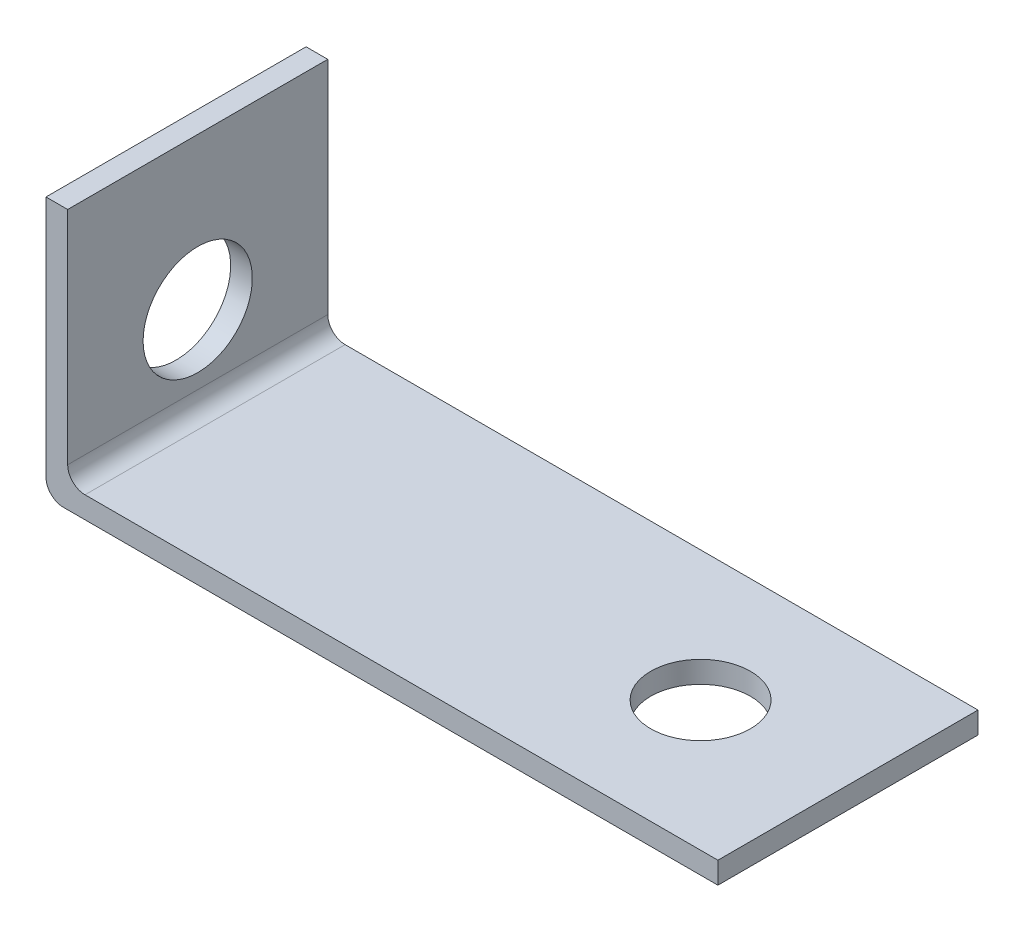
ISO-10303-21;
HEADER;
FILE_DESCRIPTION(('STEP AP214'),'2;1');
FILE_NAME('part.step','',(''),(''),'','','');
FILE_SCHEMA(('AUTOMOTIVE_DESIGN { 1 0 10303 214 1 1 1 1 }'));
ENDSEC;
DATA;
#1=APPLICATION_CONTEXT('core data for automotive mechanical design processes');
#2=APPLICATION_PROTOCOL_DEFINITION('international standard','automotive_design',2000,#1);
#3=PRODUCT_CONTEXT('',#1,'mechanical');
#4=PRODUCT('Part','Part','',(#3));
#5=PRODUCT_RELATED_PRODUCT_CATEGORY('part','',(#4));
#6=PRODUCT_DEFINITION_FORMATION('','',#4);
#7=PRODUCT_DEFINITION_CONTEXT('part definition',#1,'design');
#8=PRODUCT_DEFINITION('design','',#6,#7);
#9=PRODUCT_DEFINITION_SHAPE('','',#8);
#10=(LENGTH_UNIT() NAMED_UNIT(*) SI_UNIT(.MILLI.,.METRE.));
#11=(NAMED_UNIT(*) PLANE_ANGLE_UNIT() SI_UNIT($,.RADIAN.));
#12=(NAMED_UNIT(*) SI_UNIT($,.STERADIAN.) SOLID_ANGLE_UNIT());
#13=UNCERTAINTY_MEASURE_WITH_UNIT(LENGTH_MEASURE(1.E-05),#10,'distance_accuracy_value','');
#14=(GEOMETRIC_REPRESENTATION_CONTEXT(3) GLOBAL_UNCERTAINTY_ASSIGNED_CONTEXT((#13)) GLOBAL_UNIT_ASSIGNED_CONTEXT((#10,
#11,#12)) REPRESENTATION_CONTEXT('',''));
#15=CARTESIAN_POINT('',(0.,0.,0.));
#16=DIRECTION('',(0.,0.,1.));
#17=DIRECTION('',(1.,0.,0.));
#18=AXIS2_PLACEMENT_3D('',#15,#16,#17);
#19=CARTESIAN_POINT('',(47.625,3.175,19.05));
#20=DIRECTION('',(-1.,0.,0.));
#21=DIRECTION('',(0.,0.,1.));
#22=AXIS2_PLACEMENT_3D('',#19,#20,#21);
#23=PLANE('',#22);
#24=DIRECTION('',(0.,0.,-1.));
#25=VECTOR('',#24,1.);
#26=CARTESIAN_POINT('',(47.625,0.,19.05));
#27=LINE('',#26,#25);
#28=CARTESIAN_POINT('',(47.625,0.,19.05));
#29=VERTEX_POINT('',#28);
#30=CARTESIAN_POINT('',(47.625,0.,-19.05));
#31=VERTEX_POINT('',#30);
#32=EDGE_CURVE('E113',#29,#31,#27,.T.);
#33=ORIENTED_EDGE('',*,*,#32,.T.);
#34=DIRECTION('',(0.,-1.,0.));
#35=VECTOR('',#34,1.);
#36=CARTESIAN_POINT('',(47.625,3.175,-19.05));
#37=LINE('',#36,#35);
#38=CARTESIAN_POINT('',(47.625,3.175,-19.05));
#39=VERTEX_POINT('',#38);
#40=EDGE_CURVE('E147',#39,#31,#37,.T.);
#41=ORIENTED_EDGE('',*,*,#40,.F.);
#42=DIRECTION('',(0.,0.,-1.));
#43=VECTOR('',#42,1.);
#44=CARTESIAN_POINT('',(47.625,3.175,19.05));
#45=LINE('',#44,#43);
#46=CARTESIAN_POINT('',(47.625,3.175,19.05));
#47=VERTEX_POINT('',#46);
#48=EDGE_CURVE('E130',#47,#39,#45,.T.);
#49=ORIENTED_EDGE('',*,*,#48,.F.);
#50=DIRECTION('',(0.,-1.,0.));
#51=VECTOR('',#50,1.);
#52=CARTESIAN_POINT('',(47.625,3.175,19.05));
#53=LINE('',#52,#51);
#54=EDGE_CURVE('E139',#47,#29,#53,.T.);
#55=ORIENTED_EDGE('',*,*,#54,.T.);
#56=EDGE_LOOP('',(#33,#41,#49,#55));
#57=FACE_BOUND('',#56,.T.);
#58=ADVANCED_FACE('F32',(#57),#23,.F.);
#59=CARTESIAN_POINT('',(-47.625,3.175,-19.05));
#60=DIRECTION('',(0.,0.,1.));
#61=DIRECTION('',(1.,0.,0.));
#62=AXIS2_PLACEMENT_3D('',#59,#60,#61);
#63=PLANE('',#62);
#64=DIRECTION('',(-1.,0.,0.));
#65=VECTOR('',#64,1.);
#66=CARTESIAN_POINT('',(-47.625,0.,-19.05));
#67=LINE('',#66,#65);
#68=CARTESIAN_POINT('',(-48.26,0.,-19.05));
#69=VERTEX_POINT('',#68);
#70=EDGE_CURVE('E142',#31,#69,#67,.T.);
#71=ORIENTED_EDGE('',*,*,#70,.T.);
#72=CARTESIAN_POINT('',(-48.26,2.54,-19.05));
#73=DIRECTION('',(0.,0.,1.));
#74=DIRECTION('',(1.,0.,0.));
#75=AXIS2_PLACEMENT_3D('',#72,#73,#74);
#76=CIRCLE('',#75,2.54);
#77=CARTESIAN_POINT('',(-50.8,2.54,-19.05));
#78=VERTEX_POINT('',#77);
#79=EDGE_CURVE('E158',#69,#78,#76,.F.);
#80=ORIENTED_EDGE('',*,*,#79,.T.);
#81=DIRECTION('',(0.,-1.,0.));
#82=VECTOR('',#81,1.);
#83=CARTESIAN_POINT('',(-50.8,0.,-19.05));
#84=LINE('',#83,#82);
#85=CARTESIAN_POINT('',(-50.8,38.1,-19.05));
#86=VERTEX_POINT('',#85);
#87=EDGE_CURVE('E104',#86,#78,#84,.T.);
#88=ORIENTED_EDGE('',*,*,#87,.F.);
#89=DIRECTION('',(1.,0.,0.));
#90=VECTOR('',#89,1.);
#91=CARTESIAN_POINT('',(-50.8,38.1,-19.05));
#92=LINE('',#91,#90);
#93=CARTESIAN_POINT('',(-47.625,38.1,-19.05));
#94=VERTEX_POINT('',#93);
#95=EDGE_CURVE('E114',#86,#94,#92,.T.);
#96=ORIENTED_EDGE('',*,*,#95,.T.);
#97=DIRECTION('',(0.,-1.,0.));
#98=VECTOR('',#97,1.);
#99=CARTESIAN_POINT('',(-47.625,0.,-19.05));
#100=LINE('',#99,#98);
#101=CARTESIAN_POINT('',(-47.625,5.715,-19.05));
#102=VERTEX_POINT('',#101);
#103=EDGE_CURVE('E123',#94,#102,#100,.T.);
#104=ORIENTED_EDGE('',*,*,#103,.T.);
#105=CARTESIAN_POINT('',(-45.085,5.715,-19.05));
#106=DIRECTION('',(0.,0.,1.));
#107=DIRECTION('',(1.,0.,0.));
#108=AXIS2_PLACEMENT_3D('',#105,#106,#107);
#109=CIRCLE('',#108,2.54);
#110=CARTESIAN_POINT('',(-45.085,3.175,-19.05));
#111=VERTEX_POINT('',#110);
#112=EDGE_CURVE('E11',#102,#111,#109,.T.);
#113=ORIENTED_EDGE('',*,*,#112,.T.);
#114=DIRECTION('',(-1.,0.,0.));
#115=VECTOR('',#114,1.);
#116=CARTESIAN_POINT('',(-47.625,3.175,-19.05));
#117=LINE('',#116,#115);
#118=EDGE_CURVE('E133',#39,#111,#117,.T.);
#119=ORIENTED_EDGE('',*,*,#118,.F.);
#120=ORIENTED_EDGE('',*,*,#40,.T.);
#121=EDGE_LOOP('',(#71,#80,#88,#96,#104,#113,#119,#120));
#122=FACE_BOUND('',#121,.T.);
#123=ADVANCED_FACE('F170',(#122),#63,.F.);
#124=CARTESIAN_POINT('',(-47.625,3.175,19.05));
#125=DIRECTION('',(0.,0.,-1.));
#126=DIRECTION('',(-1.,0.,0.));
#127=AXIS2_PLACEMENT_3D('',#124,#125,#126);
#128=PLANE('',#127);
#129=DIRECTION('',(0.,1.,0.));
#130=VECTOR('',#129,1.);
#131=CARTESIAN_POINT('',(-50.8,0.,19.05));
#132=LINE('',#131,#130);
#133=CARTESIAN_POINT('',(-50.8,2.54,19.05));
#134=VERTEX_POINT('',#133);
#135=CARTESIAN_POINT('',(-50.8,38.1,19.05));
#136=VERTEX_POINT('',#135);
#137=EDGE_CURVE('E95',#134,#136,#132,.T.);
#138=ORIENTED_EDGE('',*,*,#137,.F.);
#139=CARTESIAN_POINT('',(-48.26,2.54,19.05));
#140=DIRECTION('',(0.,0.,-1.));
#141=DIRECTION('',(-1.,0.,0.));
#142=AXIS2_PLACEMENT_3D('',#139,#140,#141);
#143=CIRCLE('',#142,2.54);
#144=CARTESIAN_POINT('',(-48.26,0.,19.05));
#145=VERTEX_POINT('',#144);
#146=EDGE_CURVE('E55',#134,#145,#143,.F.);
#147=ORIENTED_EDGE('',*,*,#146,.T.);
#148=DIRECTION('',(1.,0.,0.));
#149=VECTOR('',#148,1.);
#150=CARTESIAN_POINT('',(-47.625,0.,19.05));
#151=LINE('',#150,#149);
#152=EDGE_CURVE('E134',#145,#29,#151,.T.);
#153=ORIENTED_EDGE('',*,*,#152,.T.);
#154=ORIENTED_EDGE('',*,*,#54,.F.);
#155=DIRECTION('',(1.,0.,0.));
#156=VECTOR('',#155,1.);
#157=CARTESIAN_POINT('',(-47.625,3.175,19.05));
#158=LINE('',#157,#156);
#159=CARTESIAN_POINT('',(-45.085,3.175,19.05));
#160=VERTEX_POINT('',#159);
#161=EDGE_CURVE('E137',#160,#47,#158,.T.);
#162=ORIENTED_EDGE('',*,*,#161,.F.);
#163=CARTESIAN_POINT('',(-45.085,5.715,19.05));
#164=DIRECTION('',(0.,0.,-1.));
#165=DIRECTION('',(-1.,0.,0.));
#166=AXIS2_PLACEMENT_3D('',#163,#164,#165);
#167=CIRCLE('',#166,2.54);
#168=CARTESIAN_POINT('',(-47.625,5.715,19.05));
#169=VERTEX_POINT('',#168);
#170=EDGE_CURVE('E40',#160,#169,#167,.T.);
#171=ORIENTED_EDGE('',*,*,#170,.T.);
#172=DIRECTION('',(0.,1.,0.));
#173=VECTOR('',#172,1.);
#174=CARTESIAN_POINT('',(-47.625,0.,19.05));
#175=LINE('',#174,#173);
#176=CARTESIAN_POINT('',(-47.625,38.1,19.05));
#177=VERTEX_POINT('',#176);
#178=EDGE_CURVE('E110',#169,#177,#175,.T.);
#179=ORIENTED_EDGE('',*,*,#178,.T.);
#180=DIRECTION('',(1.,0.,0.));
#181=VECTOR('',#180,1.);
#182=CARTESIAN_POINT('',(-50.8,38.1,19.05));
#183=LINE('',#182,#181);
#184=EDGE_CURVE('E107',#136,#177,#183,.T.);
#185=ORIENTED_EDGE('',*,*,#184,.F.);
#186=EDGE_LOOP('',(#138,#147,#153,#154,#162,#171,#179,#185));
#187=FACE_BOUND('',#186,.T.);
#188=ADVANCED_FACE('F108',(#187),#128,.F.);
#189=CARTESIAN_POINT('',(0.,3.175,0.));
#190=DIRECTION('',(0.,-1.,0.));
#191=DIRECTION('',(0.,0.,-1.));
#192=AXIS2_PLACEMENT_3D('',#189,#190,#191);
#193=PLANE('',#192);
#194=CARTESIAN_POINT('',(26.035,3.175,0.));
#195=DIRECTION('',(0.,-1.,0.));
#196=DIRECTION('',(0.,0.,-1.));
#197=AXIS2_PLACEMENT_3D('',#194,#195,#196);
#198=CIRCLE('',#197,7.30250000000001);
#199=CARTESIAN_POINT('',(26.035,3.175,-7.30250000000001));
#200=VERTEX_POINT('',#199);
#201=EDGE_CURVE('E126',#200,#200,#198,.F.);
#202=ORIENTED_EDGE('',*,*,#201,.F.);
#203=EDGE_LOOP('',(#202));
#204=FACE_BOUND('',#203,.T.);
#205=ORIENTED_EDGE('',*,*,#118,.T.);
#206=DIRECTION('',(0.,0.,1.));
#207=VECTOR('',#206,1.);
#208=CARTESIAN_POINT('',(-45.085,3.175,0.));
#209=LINE('',#208,#207);
#210=EDGE_CURVE('E150',#111,#160,#209,.T.);
#211=ORIENTED_EDGE('',*,*,#210,.T.);
#212=ORIENTED_EDGE('',*,*,#161,.T.);
#213=ORIENTED_EDGE('',*,*,#48,.T.);
#214=EDGE_LOOP('',(#205,#211,#212,#213));
#215=FACE_BOUND('',#214,.T.);
#216=ADVANCED_FACE('F172',(#204,#215),#193,.F.);
#217=CARTESIAN_POINT('',(0.,0.,0.));
#218=DIRECTION('',(0.,-1.,0.));
#219=DIRECTION('',(0.,0.,-1.));
#220=AXIS2_PLACEMENT_3D('',#217,#218,#219);
#221=PLANE('',#220);
#222=CARTESIAN_POINT('',(26.035,0.,0.));
#223=DIRECTION('',(0.,1.,0.));
#224=DIRECTION('',(0.,0.,1.));
#225=AXIS2_PLACEMENT_3D('',#222,#223,#224);
#226=CIRCLE('',#225,7.30250000000001);
#227=CARTESIAN_POINT('',(26.035,0.,7.30250000000001));
#228=VERTEX_POINT('',#227);
#229=EDGE_CURVE('E224',#228,#228,#226,.T.);
#230=ORIENTED_EDGE('',*,*,#229,.T.);
#231=EDGE_LOOP('',(#230));
#232=FACE_BOUND('',#231,.T.);
#233=ORIENTED_EDGE('',*,*,#152,.F.);
#234=DIRECTION('',(0.,0.,1.));
#235=VECTOR('',#234,1.);
#236=CARTESIAN_POINT('',(-48.26,0.,-19.05));
#237=LINE('',#236,#235);
#238=EDGE_CURVE('E47',#145,#69,#237,.F.);
#239=ORIENTED_EDGE('',*,*,#238,.T.);
#240=ORIENTED_EDGE('',*,*,#70,.F.);
#241=ORIENTED_EDGE('',*,*,#32,.F.);
#242=EDGE_LOOP('',(#233,#239,#240,#241));
#243=FACE_BOUND('',#242,.T.);
#244=ADVANCED_FACE('F193',(#232,#243),#221,.T.);
#245=CARTESIAN_POINT('',(-47.625,0.,0.));
#246=DIRECTION('',(1.,0.,0.));
#247=DIRECTION('',(0.,0.,-1.));
#248=AXIS2_PLACEMENT_3D('',#245,#246,#247);
#249=PLANE('',#248);
#250=CARTESIAN_POINT('',(-47.625,15.875,0.));
#251=DIRECTION('',(-1.,0.,0.));
#252=DIRECTION('',(0.,0.,1.));
#253=AXIS2_PLACEMENT_3D('',#250,#251,#252);
#254=CIRCLE('',#253,8.001);
#255=CARTESIAN_POINT('',(-47.625,15.875,8.001));
#256=VERTEX_POINT('',#255);
#257=EDGE_CURVE('E222',#256,#256,#254,.T.);
#258=ORIENTED_EDGE('',*,*,#257,.T.);
#259=EDGE_LOOP('',(#258));
#260=FACE_BOUND('',#259,.T.);
#261=ORIENTED_EDGE('',*,*,#178,.F.);
#262=DIRECTION('',(0.,0.,1.));
#263=VECTOR('',#262,1.);
#264=CARTESIAN_POINT('',(-47.625,5.715,0.));
#265=LINE('',#264,#263);
#266=EDGE_CURVE('E153',#169,#102,#265,.F.);
#267=ORIENTED_EDGE('',*,*,#266,.T.);
#268=ORIENTED_EDGE('',*,*,#103,.F.);
#269=DIRECTION('',(0.,0.,-1.));
#270=VECTOR('',#269,1.);
#271=CARTESIAN_POINT('',(-47.625,38.1,-19.05));
#272=LINE('',#271,#270);
#273=EDGE_CURVE('E128',#177,#94,#272,.T.);
#274=ORIENTED_EDGE('',*,*,#273,.F.);
#275=EDGE_LOOP('',(#261,#267,#268,#274));
#276=FACE_BOUND('',#275,.T.);
#277=ADVANCED_FACE('F165',(#260,#276),#249,.T.);
#278=CARTESIAN_POINT('',(-50.8,38.1,-19.05));
#279=DIRECTION('',(0.,-1.,0.));
#280=DIRECTION('',(0.,0.,-1.));
#281=AXIS2_PLACEMENT_3D('',#278,#279,#280);
#282=PLANE('',#281);
#283=ORIENTED_EDGE('',*,*,#273,.T.);
#284=ORIENTED_EDGE('',*,*,#95,.F.);
#285=DIRECTION('',(0.,0.,-1.));
#286=VECTOR('',#285,1.);
#287=CARTESIAN_POINT('',(-50.8,38.1,-19.05));
#288=LINE('',#287,#286);
#289=EDGE_CURVE('E100',#136,#86,#288,.T.);
#290=ORIENTED_EDGE('',*,*,#289,.F.);
#291=ORIENTED_EDGE('',*,*,#184,.T.);
#292=EDGE_LOOP('',(#283,#284,#290,#291));
#293=FACE_BOUND('',#292,.T.);
#294=ADVANCED_FACE('F116',(#293),#282,.F.);
#295=CARTESIAN_POINT('',(-50.8,0.,0.));
#296=DIRECTION('',(1.,0.,0.));
#297=DIRECTION('',(0.,0.,-1.));
#298=AXIS2_PLACEMENT_3D('',#295,#296,#297);
#299=PLANE('',#298);
#300=CARTESIAN_POINT('',(-50.8,15.875,0.));
#301=DIRECTION('',(-1.,0.,0.));
#302=DIRECTION('',(0.,0.,1.));
#303=AXIS2_PLACEMENT_3D('',#300,#301,#302);
#304=CIRCLE('',#303,8.001);
#305=CARTESIAN_POINT('',(-50.8,15.875,8.001));
#306=VERTEX_POINT('',#305);
#307=EDGE_CURVE('E219',#306,#306,#304,.T.);
#308=ORIENTED_EDGE('',*,*,#307,.F.);
#309=EDGE_LOOP('',(#308));
#310=FACE_BOUND('',#309,.T.);
#311=ORIENTED_EDGE('',*,*,#87,.T.);
#312=DIRECTION('',(0.,0.,1.));
#313=VECTOR('',#312,1.);
#314=CARTESIAN_POINT('',(-50.8,2.54,19.05));
#315=LINE('',#314,#313);
#316=EDGE_CURVE('E103',#78,#134,#315,.T.);
#317=ORIENTED_EDGE('',*,*,#316,.T.);
#318=ORIENTED_EDGE('',*,*,#137,.T.);
#319=ORIENTED_EDGE('',*,*,#289,.T.);
#320=EDGE_LOOP('',(#311,#317,#318,#319));
#321=FACE_BOUND('',#320,.T.);
#322=ADVANCED_FACE('F98',(#310,#321),#299,.F.);
#323=CARTESIAN_POINT('',(26.035,38.1,0.));
#324=DIRECTION('',(0.,-1.,0.));
#325=DIRECTION('',(0.,0.,-1.));
#326=AXIS2_PLACEMENT_3D('',#323,#324,#325);
#327=CYLINDRICAL_SURFACE('',#326,7.30250000000001);
#328=ORIENTED_EDGE('',*,*,#229,.F.);
#329=EDGE_LOOP('',(#328));
#330=FACE_BOUND('',#329,.T.);
#331=ORIENTED_EDGE('',*,*,#201,.T.);
#332=EDGE_LOOP('',(#331));
#333=FACE_BOUND('',#332,.T.);
#334=ADVANCED_FACE('F207',(#330,#333),#327,.F.);
#335=CARTESIAN_POINT('',(-50.8,15.875,0.));
#336=DIRECTION('',(1.,0.,0.));
#337=DIRECTION('',(0.,0.,-1.));
#338=AXIS2_PLACEMENT_3D('',#335,#336,#337);
#339=CYLINDRICAL_SURFACE('',#338,8.001);
#340=ORIENTED_EDGE('',*,*,#307,.T.);
#341=EDGE_LOOP('',(#340));
#342=FACE_BOUND('',#341,.T.);
#343=ORIENTED_EDGE('',*,*,#257,.F.);
#344=EDGE_LOOP('',(#343));
#345=FACE_BOUND('',#344,.T.);
#346=ADVANCED_FACE('F183',(#342,#345),#339,.F.);
#347=CARTESIAN_POINT('',(-45.085,5.715,0.));
#348=DIRECTION('',(0.,0.,1.));
#349=DIRECTION('',(1.,0.,0.));
#350=AXIS2_PLACEMENT_3D('',#347,#348,#349);
#351=CYLINDRICAL_SURFACE('',#350,2.54);
#352=ORIENTED_EDGE('',*,*,#112,.F.);
#353=ORIENTED_EDGE('',*,*,#266,.F.);
#354=ORIENTED_EDGE('',*,*,#170,.F.);
#355=ORIENTED_EDGE('',*,*,#210,.F.);
#356=EDGE_LOOP('',(#352,#353,#354,#355));
#357=FACE_BOUND('',#356,.T.);
#358=ADVANCED_FACE('F168',(#357),#351,.F.);
#359=CARTESIAN_POINT('',(-48.26,2.54,0.));
#360=DIRECTION('',(0.,0.,-1.));
#361=DIRECTION('',(-1.,0.,0.));
#362=AXIS2_PLACEMENT_3D('',#359,#360,#361);
#363=CYLINDRICAL_SURFACE('',#362,2.54);
#364=ORIENTED_EDGE('',*,*,#79,.F.);
#365=ORIENTED_EDGE('',*,*,#238,.F.);
#366=ORIENTED_EDGE('',*,*,#146,.F.);
#367=ORIENTED_EDGE('',*,*,#316,.F.);
#368=EDGE_LOOP('',(#364,#365,#366,#367));
#369=FACE_BOUND('',#368,.T.);
#370=ADVANCED_FACE('F34',(#369),#363,.T.);
#371=CLOSED_SHELL('',(#58,#123,#188,#216,#244,#277,#294,#322,#334,#346,#358,#370));
#372=MANIFOLD_SOLID_BREP('B2',#371);
#373=ADVANCED_BREP_SHAPE_REPRESENTATION('',(#18,#372),#14);
#374=SHAPE_DEFINITION_REPRESENTATION(#9,#373);
ENDSEC;
END-ISO-10303-21;
